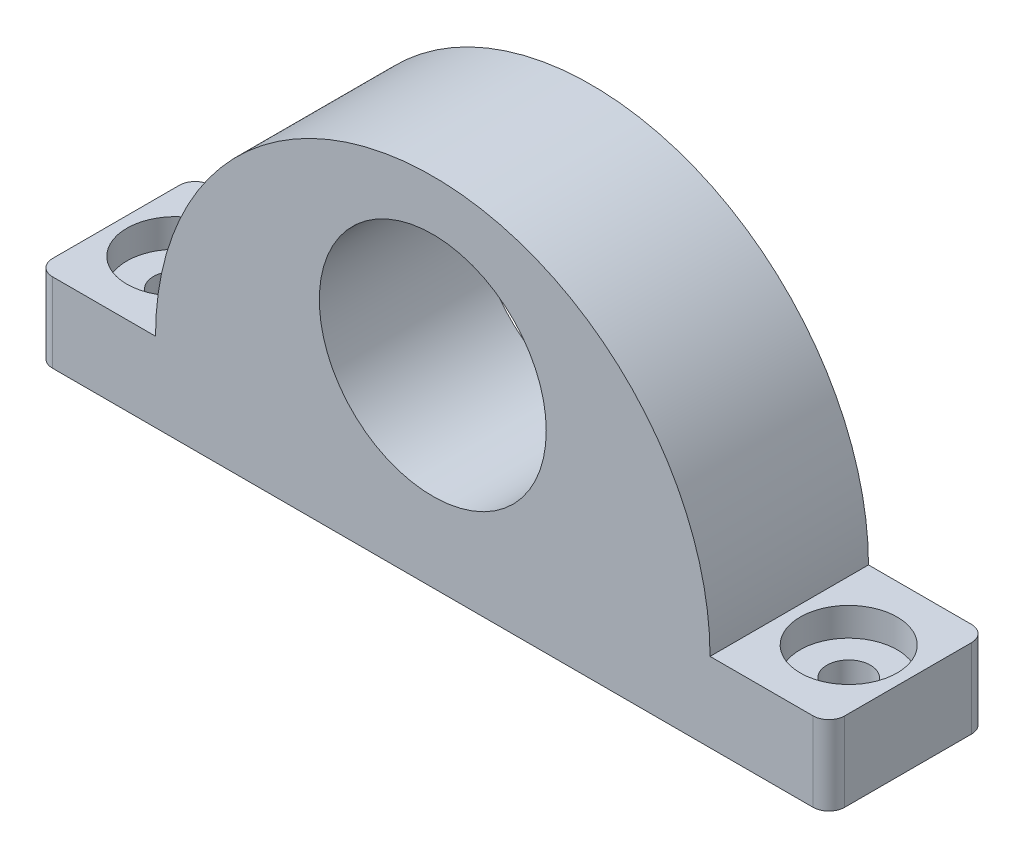
ISO-10303-21;
HEADER;
FILE_DESCRIPTION(('STEP AP214'),'2;1');
FILE_NAME('part.step','',(''),(''),'','','');
FILE_SCHEMA(('AUTOMOTIVE_DESIGN { 1 0 10303 214 1 1 1 1 }'));
ENDSEC;
DATA;
#1=APPLICATION_CONTEXT('core data for automotive mechanical design processes');
#2=APPLICATION_PROTOCOL_DEFINITION('international standard','automotive_design',2000,#1);
#3=PRODUCT_CONTEXT('',#1,'mechanical');
#4=PRODUCT('Part','Part','',(#3));
#5=PRODUCT_RELATED_PRODUCT_CATEGORY('part','',(#4));
#6=PRODUCT_DEFINITION_FORMATION('','',#4);
#7=PRODUCT_DEFINITION_CONTEXT('part definition',#1,'design');
#8=PRODUCT_DEFINITION('design','',#6,#7);
#9=PRODUCT_DEFINITION_SHAPE('','',#8);
#10=(LENGTH_UNIT() NAMED_UNIT(*) SI_UNIT(.MILLI.,.METRE.));
#11=(NAMED_UNIT(*) PLANE_ANGLE_UNIT() SI_UNIT($,.RADIAN.));
#12=(NAMED_UNIT(*) SI_UNIT($,.STERADIAN.) SOLID_ANGLE_UNIT());
#13=UNCERTAINTY_MEASURE_WITH_UNIT(LENGTH_MEASURE(1.E-05),#10,'distance_accuracy_value','');
#14=(GEOMETRIC_REPRESENTATION_CONTEXT(3) GLOBAL_UNCERTAINTY_ASSIGNED_CONTEXT((#13)) GLOBAL_UNIT_ASSIGNED_CONTEXT((#10,
#11,#12)) REPRESENTATION_CONTEXT('',''));
#15=CARTESIAN_POINT('',(0.,0.,0.));
#16=DIRECTION('',(0.,0.,1.));
#17=DIRECTION('',(1.,0.,0.));
#18=AXIS2_PLACEMENT_3D('',#15,#16,#17);
#19=CARTESIAN_POINT('',(-50.,0.,20.));
#20=DIRECTION('',(-1.,0.,0.));
#21=DIRECTION('',(0.,0.,1.));
#22=AXIS2_PLACEMENT_3D('',#19,#20,#21);
#23=PLANE('',#22);
#24=DIRECTION('',(0.,0.,-1.));
#25=VECTOR('',#24,1.);
#26=CARTESIAN_POINT('',(-50.,5.,20.));
#27=LINE('',#26,#25);
#28=CARTESIAN_POINT('',(-50.,5.,18.));
#29=VERTEX_POINT('',#28);
#30=CARTESIAN_POINT('',(-50.,5.,2.));
#31=VERTEX_POINT('',#30);
#32=EDGE_CURVE('E148',#29,#31,#27,.T.);
#33=ORIENTED_EDGE('',*,*,#32,.T.);
#34=DIRECTION('',(0.,1.,0.));
#35=VECTOR('',#34,1.);
#36=CARTESIAN_POINT('',(-50.,-5.,2.));
#37=LINE('',#36,#35);
#38=CARTESIAN_POINT('',(-50.,-5.,2.));
#39=VERTEX_POINT('',#38);
#40=EDGE_CURVE('E183',#31,#39,#37,.F.);
#41=ORIENTED_EDGE('',*,*,#40,.T.);
#42=DIRECTION('',(0.,0.,-1.));
#43=VECTOR('',#42,1.);
#44=CARTESIAN_POINT('',(-50.,-5.,20.));
#45=LINE('',#44,#43);
#46=CARTESIAN_POINT('',(-50.,-5.,18.));
#47=VERTEX_POINT('',#46);
#48=EDGE_CURVE('E168',#47,#39,#45,.T.);
#49=ORIENTED_EDGE('',*,*,#48,.F.);
#50=DIRECTION('',(0.,1.,0.));
#51=VECTOR('',#50,1.);
#52=CARTESIAN_POINT('',(-50.,0.,18.));
#53=LINE('',#52,#51);
#54=EDGE_CURVE('E180',#47,#29,#53,.T.);
#55=ORIENTED_EDGE('',*,*,#54,.T.);
#56=EDGE_LOOP('',(#33,#41,#49,#55));
#57=FACE_BOUND('',#56,.T.);
#58=ADVANCED_FACE('F34',(#57),#23,.T.);
#59=CARTESIAN_POINT('',(0.,-5.,20.));
#60=DIRECTION('',(0.,-1.,0.));
#61=DIRECTION('',(1.,0.,0.));
#62=AXIS2_PLACEMENT_3D('',#59,#60,#61);
#63=PLANE('',#62);
#64=CARTESIAN_POINT('',(-42.5,-5.,10.));
#65=DIRECTION('',(0.,-1.,0.));
#66=DIRECTION('',(1.,0.,0.));
#67=AXIS2_PLACEMENT_3D('',#64,#65,#66);
#68=CIRCLE('',#67,2.75);
#69=CARTESIAN_POINT('',(-39.75,-5.,10.));
#70=VERTEX_POINT('',#69);
#71=EDGE_CURVE('E419',#70,#70,#68,.T.);
#72=ORIENTED_EDGE('',*,*,#71,.F.);
#73=EDGE_LOOP('',(#72));
#74=FACE_BOUND('',#73,.T.);
#75=CARTESIAN_POINT('',(42.5,-4.99999999999999,10.));
#76=DIRECTION('',(0.,-1.,0.));
#77=DIRECTION('',(1.,0.,0.));
#78=AXIS2_PLACEMENT_3D('',#75,#76,#77);
#79=CIRCLE('',#78,2.75);
#80=CARTESIAN_POINT('',(45.25,-4.99999999999999,10.));
#81=VERTEX_POINT('',#80);
#82=EDGE_CURVE('E152',#81,#81,#79,.T.);
#83=ORIENTED_EDGE('',*,*,#82,.F.);
#84=EDGE_LOOP('',(#83));
#85=FACE_BOUND('',#84,.T.);
#86=ORIENTED_EDGE('',*,*,#48,.T.);
#87=CARTESIAN_POINT('',(-48.,-5.,2.));
#88=DIRECTION('',(0.,-1.,0.));
#89=DIRECTION('',(1.,0.,0.));
#90=AXIS2_PLACEMENT_3D('',#87,#88,#89);
#91=CIRCLE('',#90,2.);
#92=CARTESIAN_POINT('',(-48.,-5.,0.));
#93=VERTEX_POINT('',#92);
#94=EDGE_CURVE('E191',#39,#93,#91,.T.);
#95=ORIENTED_EDGE('',*,*,#94,.T.);
#96=DIRECTION('',(-1.,0.,0.));
#97=VECTOR('',#96,1.);
#98=CARTESIAN_POINT('',(0.,-5.,0.));
#99=LINE('',#98,#97);
#100=CARTESIAN_POINT('',(48.,-4.99999999999999,0.));
#101=VERTEX_POINT('',#100);
#102=EDGE_CURVE('E149',#101,#93,#99,.T.);
#103=ORIENTED_EDGE('',*,*,#102,.F.);
#104=CARTESIAN_POINT('',(48.,-4.99999999999999,2.));
#105=DIRECTION('',(0.,-1.,0.));
#106=DIRECTION('',(1.,0.,0.));
#107=AXIS2_PLACEMENT_3D('',#104,#105,#106);
#108=CIRCLE('',#107,2.);
#109=CARTESIAN_POINT('',(50.,-4.99999999999997,2.));
#110=VERTEX_POINT('',#109);
#111=EDGE_CURVE('E189',#101,#110,#108,.T.);
#112=ORIENTED_EDGE('',*,*,#111,.T.);
#113=DIRECTION('',(0.,0.,-1.));
#114=VECTOR('',#113,1.);
#115=CARTESIAN_POINT('',(50.,-4.99999999999997,20.));
#116=LINE('',#115,#114);
#117=CARTESIAN_POINT('',(50.,-4.99999999999997,18.));
#118=VERTEX_POINT('',#117);
#119=EDGE_CURVE('E165',#118,#110,#116,.T.);
#120=ORIENTED_EDGE('',*,*,#119,.F.);
#121=CARTESIAN_POINT('',(48.,-4.99999999999999,18.));
#122=DIRECTION('',(0.,-1.,0.));
#123=DIRECTION('',(1.,0.,0.));
#124=AXIS2_PLACEMENT_3D('',#121,#122,#123);
#125=CIRCLE('',#124,2.);
#126=CARTESIAN_POINT('',(48.,-4.99999999999999,20.));
#127=VERTEX_POINT('',#126);
#128=EDGE_CURVE('E187',#118,#127,#125,.T.);
#129=ORIENTED_EDGE('',*,*,#128,.T.);
#130=DIRECTION('',(-1.,0.,0.));
#131=VECTOR('',#130,1.);
#132=CARTESIAN_POINT('',(0.,-5.,20.));
#133=LINE('',#132,#131);
#134=CARTESIAN_POINT('',(-48.,-5.,20.));
#135=VERTEX_POINT('',#134);
#136=EDGE_CURVE('E137',#127,#135,#133,.T.);
#137=ORIENTED_EDGE('',*,*,#136,.T.);
#138=CARTESIAN_POINT('',(-48.,-5.,18.));
#139=DIRECTION('',(0.,-1.,0.));
#140=DIRECTION('',(1.,0.,0.));
#141=AXIS2_PLACEMENT_3D('',#138,#139,#140);
#142=CIRCLE('',#141,2.);
#143=EDGE_CURVE('E185',#135,#47,#142,.T.);
#144=ORIENTED_EDGE('',*,*,#143,.T.);
#145=EDGE_LOOP('',(#86,#95,#103,#112,#120,#129,#137,#144));
#146=FACE_BOUND('',#145,.T.);
#147=ADVANCED_FACE('F202',(#74,#85,#146),#63,.T.);
#148=CARTESIAN_POINT('',(50.,0.,20.));
#149=DIRECTION('',(-1.,0.,0.));
#150=DIRECTION('',(0.,0.,1.));
#151=AXIS2_PLACEMENT_3D('',#148,#149,#150);
#152=PLANE('',#151);
#153=ORIENTED_EDGE('',*,*,#119,.T.);
#154=DIRECTION('',(0.,1.,0.));
#155=VECTOR('',#154,1.);
#156=CARTESIAN_POINT('',(50.,0.,2.));
#157=LINE('',#156,#155);
#158=CARTESIAN_POINT('',(50.,5.00000000000003,2.));
#159=VERTEX_POINT('',#158);
#160=EDGE_CURVE('E195',#110,#159,#157,.T.);
#161=ORIENTED_EDGE('',*,*,#160,.T.);
#162=DIRECTION('',(0.,0.,-1.));
#163=VECTOR('',#162,1.);
#164=CARTESIAN_POINT('',(50.,5.00000000000003,20.));
#165=LINE('',#164,#163);
#166=CARTESIAN_POINT('',(50.,5.00000000000003,18.));
#167=VERTEX_POINT('',#166);
#168=EDGE_CURVE('E122',#167,#159,#165,.T.);
#169=ORIENTED_EDGE('',*,*,#168,.F.);
#170=DIRECTION('',(0.,1.,0.));
#171=VECTOR('',#170,1.);
#172=CARTESIAN_POINT('',(50.,-4.99999999999997,18.));
#173=LINE('',#172,#171);
#174=EDGE_CURVE('E193',#167,#118,#173,.F.);
#175=ORIENTED_EDGE('',*,*,#174,.T.);
#176=EDGE_LOOP('',(#153,#161,#169,#175));
#177=FACE_BOUND('',#176,.T.);
#178=ADVANCED_FACE('F225',(#177),#152,.F.);
#179=CARTESIAN_POINT('',(0.,4.99999999999992,20.));
#180=DIRECTION('',(0.,1.,0.));
#181=DIRECTION('',(-1.,0.,0.));
#182=AXIS2_PLACEMENT_3D('',#179,#180,#181);
#183=PLANE('',#182);
#184=CARTESIAN_POINT('',(42.5,5.00000000000001,10.));
#185=DIRECTION('',(0.,1.,0.));
#186=DIRECTION('',(0.,0.,1.));
#187=AXIS2_PLACEMENT_3D('',#184,#185,#186);
#188=CIRCLE('',#187,6.12);
#189=CARTESIAN_POINT('',(42.5,5.00000000000001,16.12));
#190=VERTEX_POINT('',#189);
#191=EDGE_CURVE('E416',#190,#190,#188,.T.);
#192=ORIENTED_EDGE('',*,*,#191,.F.);
#193=EDGE_LOOP('',(#192));
#194=FACE_BOUND('',#193,.T.);
#195=ORIENTED_EDGE('',*,*,#168,.T.);
#196=CARTESIAN_POINT('',(48.,5.00000000000003,2.));
#197=DIRECTION('',(0.,1.,0.));
#198=DIRECTION('',(-1.,0.,0.));
#199=AXIS2_PLACEMENT_3D('',#196,#197,#198);
#200=CIRCLE('',#199,2.);
#201=CARTESIAN_POINT('',(48.,5.00000000000003,0.));
#202=VERTEX_POINT('',#201);
#203=EDGE_CURVE('E56',#159,#202,#200,.T.);
#204=ORIENTED_EDGE('',*,*,#203,.T.);
#205=DIRECTION('',(1.,0.,0.));
#206=VECTOR('',#205,1.);
#207=CARTESIAN_POINT('',(0.,4.99999999999992,0.));
#208=LINE('',#207,#206);
#209=CARTESIAN_POINT('',(35.,5.,0.));
#210=VERTEX_POINT('',#209);
#211=EDGE_CURVE('E119',#210,#202,#208,.T.);
#212=ORIENTED_EDGE('',*,*,#211,.F.);
#213=DIRECTION('',(0.,0.,-1.));
#214=VECTOR('',#213,1.);
#215=CARTESIAN_POINT('',(35.,5.,20.));
#216=LINE('',#215,#214);
#217=CARTESIAN_POINT('',(35.,5.,20.));
#218=VERTEX_POINT('',#217);
#219=EDGE_CURVE('E112',#218,#210,#216,.T.);
#220=ORIENTED_EDGE('',*,*,#219,.F.);
#221=DIRECTION('',(1.,0.,0.));
#222=VECTOR('',#221,1.);
#223=CARTESIAN_POINT('',(0.,4.99999999999992,20.));
#224=LINE('',#223,#222);
#225=CARTESIAN_POINT('',(48.,5.00000000000003,20.));
#226=VERTEX_POINT('',#225);
#227=EDGE_CURVE('E117',#218,#226,#224,.T.);
#228=ORIENTED_EDGE('',*,*,#227,.T.);
#229=CARTESIAN_POINT('',(48.,5.00000000000003,18.));
#230=DIRECTION('',(0.,1.,0.));
#231=DIRECTION('',(-1.,0.,0.));
#232=AXIS2_PLACEMENT_3D('',#229,#230,#231);
#233=CIRCLE('',#232,2.);
#234=EDGE_CURVE('E49',#226,#167,#233,.T.);
#235=ORIENTED_EDGE('',*,*,#234,.T.);
#236=EDGE_LOOP('',(#195,#204,#212,#220,#228,#235));
#237=FACE_BOUND('',#236,.T.);
#238=ADVANCED_FACE('F115',(#194,#237),#183,.T.);
#239=CARTESIAN_POINT('',(0.,5.,20.));
#240=DIRECTION('',(0.,0.,-1.));
#241=DIRECTION('',(-1.,0.,0.));
#242=AXIS2_PLACEMENT_3D('',#239,#240,#241);
#243=CYLINDRICAL_SURFACE('',#242,35.);
#244=CARTESIAN_POINT('',(0.,5.,0.));
#245=DIRECTION('',(0.,0.,1.));
#246=DIRECTION('',(1.,0.,0.));
#247=AXIS2_PLACEMENT_3D('',#244,#245,#246);
#248=CIRCLE('',#247,35.);
#249=CARTESIAN_POINT('',(-35.,5.,0.));
#250=VERTEX_POINT('',#249);
#251=EDGE_CURVE('E154',#210,#250,#248,.T.);
#252=ORIENTED_EDGE('',*,*,#251,.T.);
#253=DIRECTION('',(0.,0.,-1.));
#254=VECTOR('',#253,1.);
#255=CARTESIAN_POINT('',(-35.,5.,20.));
#256=LINE('',#255,#254);
#257=CARTESIAN_POINT('',(-35.,5.,20.));
#258=VERTEX_POINT('',#257);
#259=EDGE_CURVE('E123',#258,#250,#256,.T.);
#260=ORIENTED_EDGE('',*,*,#259,.F.);
#261=CARTESIAN_POINT('',(0.,5.,20.));
#262=DIRECTION('',(0.,0.,1.));
#263=DIRECTION('',(1.,0.,0.));
#264=AXIS2_PLACEMENT_3D('',#261,#262,#263);
#265=CIRCLE('',#264,35.);
#266=EDGE_CURVE('E126',#218,#258,#265,.T.);
#267=ORIENTED_EDGE('',*,*,#266,.F.);
#268=ORIENTED_EDGE('',*,*,#219,.T.);
#269=EDGE_LOOP('',(#252,#260,#267,#268));
#270=FACE_BOUND('',#269,.T.);
#271=ADVANCED_FACE('F127',(#270),#243,.T.);
#272=CARTESIAN_POINT('',(0.,5.,20.));
#273=DIRECTION('',(0.,-1.,0.));
#274=DIRECTION('',(1.,0.,0.));
#275=AXIS2_PLACEMENT_3D('',#272,#273,#274);
#276=PLANE('',#275);
#277=CARTESIAN_POINT('',(-42.5,5.,10.));
#278=DIRECTION('',(0.,1.,0.));
#279=DIRECTION('',(0.,0.,1.));
#280=AXIS2_PLACEMENT_3D('',#277,#278,#279);
#281=CIRCLE('',#280,6.12);
#282=CARTESIAN_POINT('',(-42.5,5.,16.12));
#283=VERTEX_POINT('',#282);
#284=EDGE_CURVE('E442',#283,#283,#281,.T.);
#285=ORIENTED_EDGE('',*,*,#284,.F.);
#286=EDGE_LOOP('',(#285));
#287=FACE_BOUND('',#286,.T.);
#288=DIRECTION('',(-1.,0.,0.));
#289=VECTOR('',#288,1.);
#290=CARTESIAN_POINT('',(0.,5.,0.));
#291=LINE('',#290,#289);
#292=CARTESIAN_POINT('',(-48.,5.,0.));
#293=VERTEX_POINT('',#292);
#294=EDGE_CURVE('E156',#250,#293,#291,.T.);
#295=ORIENTED_EDGE('',*,*,#294,.T.);
#296=CARTESIAN_POINT('',(-48.,5.,2.));
#297=DIRECTION('',(0.,-1.,0.));
#298=DIRECTION('',(1.,0.,0.));
#299=AXIS2_PLACEMENT_3D('',#296,#297,#298);
#300=CIRCLE('',#299,2.);
#301=EDGE_CURVE('E178',#293,#31,#300,.F.);
#302=ORIENTED_EDGE('',*,*,#301,.T.);
#303=ORIENTED_EDGE('',*,*,#32,.F.);
#304=CARTESIAN_POINT('',(-48.,5.,18.));
#305=DIRECTION('',(0.,-1.,0.));
#306=DIRECTION('',(1.,0.,0.));
#307=AXIS2_PLACEMENT_3D('',#304,#305,#306);
#308=CIRCLE('',#307,2.);
#309=CARTESIAN_POINT('',(-48.,5.,20.));
#310=VERTEX_POINT('',#309);
#311=EDGE_CURVE('E176',#29,#310,#308,.F.);
#312=ORIENTED_EDGE('',*,*,#311,.T.);
#313=DIRECTION('',(-1.,0.,0.));
#314=VECTOR('',#313,1.);
#315=CARTESIAN_POINT('',(0.,5.,20.));
#316=LINE('',#315,#314);
#317=EDGE_CURVE('E132',#258,#310,#316,.T.);
#318=ORIENTED_EDGE('',*,*,#317,.F.);
#319=ORIENTED_EDGE('',*,*,#259,.T.);
#320=EDGE_LOOP('',(#295,#302,#303,#312,#318,#319));
#321=FACE_BOUND('',#320,.T.);
#322=ADVANCED_FACE('F211',(#287,#321),#276,.F.);
#323=CARTESIAN_POINT('',(0.,19.325,20.));
#324=DIRECTION('',(0.,0.,-1.));
#325=DIRECTION('',(-1.,0.,0.));
#326=AXIS2_PLACEMENT_3D('',#323,#324,#325);
#327=CYLINDRICAL_SURFACE('',#326,14.325);
#328=CARTESIAN_POINT('',(0.,19.325,20.));
#329=DIRECTION('',(0.,0.,1.));
#330=DIRECTION('',(1.,0.,0.));
#331=AXIS2_PLACEMENT_3D('',#328,#329,#330);
#332=CIRCLE('',#331,14.325);
#333=CARTESIAN_POINT('',(14.325,19.325,20.));
#334=VERTEX_POINT('',#333);
#335=EDGE_CURVE('E145',#334,#334,#332,.T.);
#336=ORIENTED_EDGE('',*,*,#335,.T.);
#337=EDGE_LOOP('',(#336));
#338=FACE_BOUND('',#337,.T.);
#339=CARTESIAN_POINT('',(0.,19.325,0.));
#340=DIRECTION('',(0.,0.,1.));
#341=DIRECTION('',(1.,0.,0.));
#342=AXIS2_PLACEMENT_3D('',#339,#340,#341);
#343=CIRCLE('',#342,14.325);
#344=CARTESIAN_POINT('',(14.325,19.325,0.));
#345=VERTEX_POINT('',#344);
#346=EDGE_CURVE('E140',#345,#345,#343,.T.);
#347=ORIENTED_EDGE('',*,*,#346,.F.);
#348=EDGE_LOOP('',(#347));
#349=FACE_BOUND('',#348,.T.);
#350=ADVANCED_FACE('F276',(#338,#349),#327,.F.);
#351=CARTESIAN_POINT('',(0.,0.,20.));
#352=DIRECTION('',(0.,0.,1.));
#353=DIRECTION('',(1.,0.,0.));
#354=AXIS2_PLACEMENT_3D('',#351,#352,#353);
#355=PLANE('',#354);
#356=ORIENTED_EDGE('',*,*,#136,.F.);
#357=DIRECTION('',(0.,1.,0.));
#358=VECTOR('',#357,1.);
#359=CARTESIAN_POINT('',(48.,5.00000000000003,20.));
#360=LINE('',#359,#358);
#361=EDGE_CURVE('E11',#127,#226,#360,.T.);
#362=ORIENTED_EDGE('',*,*,#361,.T.);
#363=ORIENTED_EDGE('',*,*,#227,.F.);
#364=ORIENTED_EDGE('',*,*,#266,.T.);
#365=ORIENTED_EDGE('',*,*,#317,.T.);
#366=DIRECTION('',(0.,1.,0.));
#367=VECTOR('',#366,1.);
#368=CARTESIAN_POINT('',(-48.,0.,20.));
#369=LINE('',#368,#367);
#370=EDGE_CURVE('E42',#310,#135,#369,.F.);
#371=ORIENTED_EDGE('',*,*,#370,.T.);
#372=EDGE_LOOP('',(#356,#362,#363,#364,#365,#371));
#373=FACE_BOUND('',#372,.T.);
#374=ORIENTED_EDGE('',*,*,#335,.F.);
#375=EDGE_LOOP('',(#374));
#376=FACE_BOUND('',#375,.T.);
#377=ADVANCED_FACE('F135',(#373,#376),#355,.T.);
#378=CARTESIAN_POINT('',(0.,0.,0.));
#379=DIRECTION('',(0.,0.,1.));
#380=DIRECTION('',(1.,0.,0.));
#381=AXIS2_PLACEMENT_3D('',#378,#379,#380);
#382=PLANE('',#381);
#383=ORIENTED_EDGE('',*,*,#102,.T.);
#384=DIRECTION('',(0.,1.,0.));
#385=VECTOR('',#384,1.);
#386=CARTESIAN_POINT('',(-48.,5.,0.));
#387=LINE('',#386,#385);
#388=EDGE_CURVE('E173',#93,#293,#387,.T.);
#389=ORIENTED_EDGE('',*,*,#388,.T.);
#390=ORIENTED_EDGE('',*,*,#294,.F.);
#391=ORIENTED_EDGE('',*,*,#251,.F.);
#392=ORIENTED_EDGE('',*,*,#211,.T.);
#393=DIRECTION('',(0.,1.,0.));
#394=VECTOR('',#393,1.);
#395=CARTESIAN_POINT('',(48.,0.,0.));
#396=LINE('',#395,#394);
#397=EDGE_CURVE('E171',#202,#101,#396,.F.);
#398=ORIENTED_EDGE('',*,*,#397,.T.);
#399=EDGE_LOOP('',(#383,#389,#390,#391,#392,#398));
#400=FACE_BOUND('',#399,.T.);
#401=ORIENTED_EDGE('',*,*,#346,.T.);
#402=EDGE_LOOP('',(#401));
#403=FACE_BOUND('',#402,.T.);
#404=ADVANCED_FACE('F218',(#400,#403),#382,.F.);
#405=CARTESIAN_POINT('',(42.5,5.00000000000001,10.));
#406=DIRECTION('',(0.,1.,0.));
#407=DIRECTION('',(0.,0.,1.));
#408=AXIS2_PLACEMENT_3D('',#405,#406,#407);
#409=CYLINDRICAL_SURFACE('',#408,2.75);
#410=CARTESIAN_POINT('',(42.5,1.42000000000001,10.));
#411=DIRECTION('',(0.,1.,0.));
#412=DIRECTION('',(0.,0.,1.));
#413=AXIS2_PLACEMENT_3D('',#410,#411,#412);
#414=CIRCLE('',#413,2.75000000000001);
#415=CARTESIAN_POINT('',(42.5,1.42000000000001,12.75));
#416=VERTEX_POINT('',#415);
#417=EDGE_CURVE('E422',#416,#416,#414,.T.);
#418=ORIENTED_EDGE('',*,*,#417,.T.);
#419=EDGE_LOOP('',(#418));
#420=FACE_BOUND('',#419,.T.);
#421=ORIENTED_EDGE('',*,*,#82,.T.);
#422=EDGE_LOOP('',(#421));
#423=FACE_BOUND('',#422,.T.);
#424=ADVANCED_FACE('F269',(#420,#423),#409,.F.);
#425=CARTESIAN_POINT('',(45.25,1.42000000000001,10.));
#426=DIRECTION('',(0.,-1.,0.));
#427=DIRECTION('',(0.,0.,-1.));
#428=AXIS2_PLACEMENT_3D('',#425,#426,#427);
#429=PLANE('',#428);
#430=ORIENTED_EDGE('',*,*,#417,.F.);
#431=EDGE_LOOP('',(#430));
#432=FACE_BOUND('',#431,.T.);
#433=CARTESIAN_POINT('',(42.5,1.42000000000001,10.));
#434=DIRECTION('',(0.,1.,0.));
#435=DIRECTION('',(0.,0.,1.));
#436=AXIS2_PLACEMENT_3D('',#433,#434,#435);
#437=CIRCLE('',#436,6.12);
#438=CARTESIAN_POINT('',(42.5,1.42000000000001,16.12));
#439=VERTEX_POINT('',#438);
#440=EDGE_CURVE('E418',#439,#439,#437,.T.);
#441=ORIENTED_EDGE('',*,*,#440,.T.);
#442=EDGE_LOOP('',(#441));
#443=FACE_BOUND('',#442,.T.);
#444=ADVANCED_FACE('F265',(#432,#443),#429,.F.);
#445=CARTESIAN_POINT('',(42.5,5.00000000000001,10.));
#446=DIRECTION('',(0.,1.,0.));
#447=DIRECTION('',(0.,0.,1.));
#448=AXIS2_PLACEMENT_3D('',#445,#446,#447);
#449=CYLINDRICAL_SURFACE('',#448,6.12);
#450=ORIENTED_EDGE('',*,*,#440,.F.);
#451=EDGE_LOOP('',(#450));
#452=FACE_BOUND('',#451,.T.);
#453=ORIENTED_EDGE('',*,*,#191,.T.);
#454=EDGE_LOOP('',(#453));
#455=FACE_BOUND('',#454,.T.);
#456=ADVANCED_FACE('F261',(#452,#455),#449,.F.);
#457=CARTESIAN_POINT('',(-42.5,5.,10.));
#458=DIRECTION('',(0.,1.,0.));
#459=DIRECTION('',(0.,0.,1.));
#460=AXIS2_PLACEMENT_3D('',#457,#458,#459);
#461=CYLINDRICAL_SURFACE('',#460,2.75);
#462=CARTESIAN_POINT('',(-42.5,1.42,10.));
#463=DIRECTION('',(0.,1.,0.));
#464=DIRECTION('',(0.,0.,1.));
#465=AXIS2_PLACEMENT_3D('',#462,#463,#464);
#466=CIRCLE('',#465,2.75000000000001);
#467=CARTESIAN_POINT('',(-42.5,1.42,12.75));
#468=VERTEX_POINT('',#467);
#469=EDGE_CURVE('E425',#468,#468,#466,.T.);
#470=ORIENTED_EDGE('',*,*,#469,.T.);
#471=EDGE_LOOP('',(#470));
#472=FACE_BOUND('',#471,.T.);
#473=ORIENTED_EDGE('',*,*,#71,.T.);
#474=EDGE_LOOP('',(#473));
#475=FACE_BOUND('',#474,.T.);
#476=ADVANCED_FACE('F253',(#472,#475),#461,.F.);
#477=CARTESIAN_POINT('',(-39.75,1.42,10.));
#478=DIRECTION('',(0.,-1.,0.));
#479=DIRECTION('',(0.,0.,-1.));
#480=AXIS2_PLACEMENT_3D('',#477,#478,#479);
#481=PLANE('',#480);
#482=ORIENTED_EDGE('',*,*,#469,.F.);
#483=EDGE_LOOP('',(#482));
#484=FACE_BOUND('',#483,.T.);
#485=CARTESIAN_POINT('',(-42.5,1.42,10.));
#486=DIRECTION('',(0.,1.,0.));
#487=DIRECTION('',(0.,0.,1.));
#488=AXIS2_PLACEMENT_3D('',#485,#486,#487);
#489=CIRCLE('',#488,6.12);
#490=CARTESIAN_POINT('',(-42.5,1.42,16.12));
#491=VERTEX_POINT('',#490);
#492=EDGE_CURVE('E439',#491,#491,#489,.T.);
#493=ORIENTED_EDGE('',*,*,#492,.T.);
#494=EDGE_LOOP('',(#493));
#495=FACE_BOUND('',#494,.T.);
#496=ADVANCED_FACE('F247',(#484,#495),#481,.F.);
#497=CARTESIAN_POINT('',(-42.5,5.,10.));
#498=DIRECTION('',(0.,1.,0.));
#499=DIRECTION('',(0.,0.,1.));
#500=AXIS2_PLACEMENT_3D('',#497,#498,#499);
#501=CYLINDRICAL_SURFACE('',#500,6.12);
#502=ORIENTED_EDGE('',*,*,#492,.F.);
#503=EDGE_LOOP('',(#502));
#504=FACE_BOUND('',#503,.T.);
#505=ORIENTED_EDGE('',*,*,#284,.T.);
#506=EDGE_LOOP('',(#505));
#507=FACE_BOUND('',#506,.T.);
#508=ADVANCED_FACE('F243',(#504,#507),#501,.F.);
#509=CARTESIAN_POINT('',(-48.,0.,2.));
#510=DIRECTION('',(0.,-1.,0.));
#511=DIRECTION('',(0.,0.,-1.));
#512=AXIS2_PLACEMENT_3D('',#509,#510,#511);
#513=CYLINDRICAL_SURFACE('',#512,2.);
#514=ORIENTED_EDGE('',*,*,#94,.F.);
#515=ORIENTED_EDGE('',*,*,#40,.F.);
#516=ORIENTED_EDGE('',*,*,#301,.F.);
#517=ORIENTED_EDGE('',*,*,#388,.F.);
#518=EDGE_LOOP('',(#514,#515,#516,#517));
#519=FACE_BOUND('',#518,.T.);
#520=ADVANCED_FACE('F216',(#519),#513,.T.);
#521=CARTESIAN_POINT('',(48.,0.,2.));
#522=DIRECTION('',(0.,1.,0.));
#523=DIRECTION('',(0.,0.,1.));
#524=AXIS2_PLACEMENT_3D('',#521,#522,#523);
#525=CYLINDRICAL_SURFACE('',#524,2.);
#526=ORIENTED_EDGE('',*,*,#111,.F.);
#527=ORIENTED_EDGE('',*,*,#397,.F.);
#528=ORIENTED_EDGE('',*,*,#203,.F.);
#529=ORIENTED_EDGE('',*,*,#160,.F.);
#530=EDGE_LOOP('',(#526,#527,#528,#529));
#531=FACE_BOUND('',#530,.T.);
#532=ADVANCED_FACE('F222',(#531),#525,.T.);
#533=CARTESIAN_POINT('',(48.,0.,18.));
#534=DIRECTION('',(0.,-1.,0.));
#535=DIRECTION('',(0.,0.,-1.));
#536=AXIS2_PLACEMENT_3D('',#533,#534,#535);
#537=CYLINDRICAL_SURFACE('',#536,2.);
#538=ORIENTED_EDGE('',*,*,#128,.F.);
#539=ORIENTED_EDGE('',*,*,#174,.F.);
#540=ORIENTED_EDGE('',*,*,#234,.F.);
#541=ORIENTED_EDGE('',*,*,#361,.F.);
#542=EDGE_LOOP('',(#538,#539,#540,#541));
#543=FACE_BOUND('',#542,.T.);
#544=ADVANCED_FACE('F226',(#543),#537,.T.);
#545=CARTESIAN_POINT('',(-48.,0.,18.));
#546=DIRECTION('',(0.,1.,0.));
#547=DIRECTION('',(0.,0.,1.));
#548=AXIS2_PLACEMENT_3D('',#545,#546,#547);
#549=CYLINDRICAL_SURFACE('',#548,2.);
#550=ORIENTED_EDGE('',*,*,#143,.F.);
#551=ORIENTED_EDGE('',*,*,#370,.F.);
#552=ORIENTED_EDGE('',*,*,#311,.F.);
#553=ORIENTED_EDGE('',*,*,#54,.F.);
#554=EDGE_LOOP('',(#550,#551,#552,#553));
#555=FACE_BOUND('',#554,.T.);
#556=ADVANCED_FACE('F36',(#555),#549,.T.);
#557=CLOSED_SHELL('',(#58,#147,#178,#238,#271,#322,#350,#377,#404,#424,#444,#456,#476,#496,#508,
#520,#532,#544,#556));
#558=MANIFOLD_SOLID_BREP('B2',#557);
#559=ADVANCED_BREP_SHAPE_REPRESENTATION('',(#18,#558),#14);
#560=SHAPE_DEFINITION_REPRESENTATION(#9,#559);
ENDSEC;
END-ISO-10303-21;
